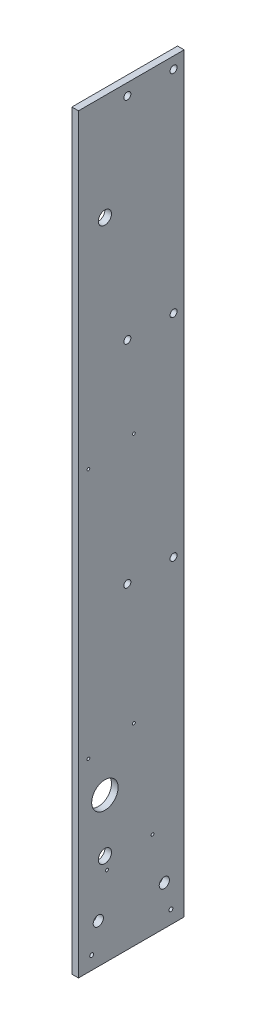
ISO-10303-21;
HEADER;
FILE_DESCRIPTION(('STEP AP214'),'2;1');
FILE_NAME('part.step','',(''),(''),'','','');
FILE_SCHEMA(('AUTOMOTIVE_DESIGN { 1 0 10303 214 1 1 1 1 }'));
ENDSEC;
DATA;
#1=APPLICATION_CONTEXT('core data for automotive mechanical design processes');
#2=APPLICATION_PROTOCOL_DEFINITION('international standard','automotive_design',2000,#1);
#3=PRODUCT_CONTEXT('',#1,'mechanical');
#4=PRODUCT('Part','Part','',(#3));
#5=PRODUCT_RELATED_PRODUCT_CATEGORY('part','',(#4));
#6=PRODUCT_DEFINITION_FORMATION('','',#4);
#7=PRODUCT_DEFINITION_CONTEXT('part definition',#1,'design');
#8=PRODUCT_DEFINITION('design','',#6,#7);
#9=PRODUCT_DEFINITION_SHAPE('','',#8);
#10=(LENGTH_UNIT() NAMED_UNIT(*) SI_UNIT(.MILLI.,.METRE.));
#11=(NAMED_UNIT(*) PLANE_ANGLE_UNIT() SI_UNIT($,.RADIAN.));
#12=(NAMED_UNIT(*) SI_UNIT($,.STERADIAN.) SOLID_ANGLE_UNIT());
#13=UNCERTAINTY_MEASURE_WITH_UNIT(LENGTH_MEASURE(1.E-05),#10,'distance_accuracy_value','');
#14=(GEOMETRIC_REPRESENTATION_CONTEXT(3) GLOBAL_UNCERTAINTY_ASSIGNED_CONTEXT((#13)) GLOBAL_UNIT_ASSIGNED_CONTEXT((#10,
#11,#12)) REPRESENTATION_CONTEXT('',''));
#15=CARTESIAN_POINT('',(0.,0.,0.));
#16=DIRECTION('',(0.,0.,1.));
#17=DIRECTION('',(1.,0.,0.));
#18=AXIS2_PLACEMENT_3D('',#15,#16,#17);
#19=CARTESIAN_POINT('',(6.35,0.,0.));
#20=DIRECTION('',(-1.,0.,0.));
#21=DIRECTION('',(0.,0.,1.));
#22=AXIS2_PLACEMENT_3D('',#19,#20,#21);
#23=PLANE('',#22);
#24=CARTESIAN_POINT('',(6.35,139.7,-25.4));
#25=DIRECTION('',(1.,0.,0.));
#26=DIRECTION('',(0.,0.,-1.));
#27=AXIS2_PLACEMENT_3D('',#24,#25,#26);
#28=CIRCLE('',#27,12.7);
#29=CARTESIAN_POINT('',(6.35,139.7,-38.1));
#30=VERTEX_POINT('',#29);
#31=EDGE_CURVE('E235',#30,#30,#28,.T.);
#32=ORIENTED_EDGE('',*,*,#31,.F.);
#33=EDGE_LOOP('',(#32));
#34=FACE_BOUND('',#33,.T.);
#35=CARTESIAN_POINT('',(6.35,88.9,-25.4));
#36=DIRECTION('',(1.,0.,0.));
#37=DIRECTION('',(0.,0.,-1.));
#38=AXIS2_PLACEMENT_3D('',#35,#36,#37);
#39=CIRCLE('',#38,6.35);
#40=CARTESIAN_POINT('',(6.35,88.9,-31.75));
#41=VERTEX_POINT('',#40);
#42=EDGE_CURVE('E229',#41,#41,#39,.T.);
#43=ORIENTED_EDGE('',*,*,#42,.F.);
#44=EDGE_LOOP('',(#43));
#45=FACE_BOUND('',#44,.T.);
#46=CARTESIAN_POINT('',(6.35,620.7125,-25.4));
#47=DIRECTION('',(1.,0.,0.));
#48=DIRECTION('',(0.,0.,-1.));
#49=AXIS2_PLACEMENT_3D('',#46,#47,#48);
#50=CIRCLE('',#49,6.35);
#51=CARTESIAN_POINT('',(6.35,620.7125,-31.75));
#52=VERTEX_POINT('',#51);
#53=EDGE_CURVE('E223',#52,#52,#50,.T.);
#54=ORIENTED_EDGE('',*,*,#53,.F.);
#55=EDGE_LOOP('',(#54));
#56=FACE_BOUND('',#55,.T.);
#57=CARTESIAN_POINT('',(6.35,38.1,-19.05));
#58=DIRECTION('',(1.,0.,0.));
#59=DIRECTION('',(0.,0.,-1.));
#60=AXIS2_PLACEMENT_3D('',#57,#58,#59);
#61=CIRCLE('',#60,4.9022);
#62=CARTESIAN_POINT('',(6.35,38.1,-23.9522));
#63=VERTEX_POINT('',#62);
#64=EDGE_CURVE('E219',#63,#63,#61,.T.);
#65=ORIENTED_EDGE('',*,*,#64,.F.);
#66=EDGE_LOOP('',(#65));
#67=FACE_BOUND('',#66,.T.);
#68=CARTESIAN_POINT('',(6.35,38.1,-82.55));
#69=DIRECTION('',(1.,0.,0.));
#70=DIRECTION('',(0.,0.,-1.));
#71=AXIS2_PLACEMENT_3D('',#68,#69,#70);
#72=CIRCLE('',#71,4.9022);
#73=CARTESIAN_POINT('',(6.35,38.1,-87.4522));
#74=VERTEX_POINT('',#73);
#75=EDGE_CURVE('E213',#74,#74,#72,.T.);
#76=ORIENTED_EDGE('',*,*,#75,.F.);
#77=EDGE_LOOP('',(#76));
#78=FACE_BOUND('',#77,.T.);
#79=CARTESIAN_POINT('',(6.35,304.8,-46.99));
#80=DIRECTION('',(1.,0.,0.));
#81=DIRECTION('',(0.,0.,-1.));
#82=AXIS2_PLACEMENT_3D('',#79,#80,#81);
#83=CIRCLE('',#82,3.3782);
#84=CARTESIAN_POINT('',(6.35,304.8,-50.3682));
#85=VERTEX_POINT('',#84);
#86=EDGE_CURVE('E207',#85,#85,#83,.T.);
#87=ORIENTED_EDGE('',*,*,#86,.F.);
#88=EDGE_LOOP('',(#87));
#89=FACE_BOUND('',#88,.T.);
#90=CARTESIAN_POINT('',(6.35,304.8,-91.44));
#91=DIRECTION('',(1.,0.,0.));
#92=DIRECTION('',(0.,0.,-1.));
#93=AXIS2_PLACEMENT_3D('',#90,#91,#92);
#94=CIRCLE('',#93,3.3782);
#95=CARTESIAN_POINT('',(6.35,304.8,-94.8182));
#96=VERTEX_POINT('',#95);
#97=EDGE_CURVE('E201',#96,#96,#94,.T.);
#98=ORIENTED_EDGE('',*,*,#97,.F.);
#99=EDGE_LOOP('',(#98));
#100=FACE_BOUND('',#99,.T.);
#101=CARTESIAN_POINT('',(6.35,508.,-46.99));
#102=DIRECTION('',(1.,0.,0.));
#103=DIRECTION('',(0.,0.,-1.));
#104=AXIS2_PLACEMENT_3D('',#101,#102,#103);
#105=CIRCLE('',#104,3.3782);
#106=CARTESIAN_POINT('',(6.35,508.,-50.3682));
#107=VERTEX_POINT('',#106);
#108=EDGE_CURVE('E195',#107,#107,#105,.T.);
#109=ORIENTED_EDGE('',*,*,#108,.F.);
#110=EDGE_LOOP('',(#109));
#111=FACE_BOUND('',#110,.T.);
#112=CARTESIAN_POINT('',(6.35,508.,-91.44));
#113=DIRECTION('',(1.,0.,0.));
#114=DIRECTION('',(0.,0.,-1.));
#115=AXIS2_PLACEMENT_3D('',#112,#113,#114);
#116=CIRCLE('',#115,3.3782);
#117=CARTESIAN_POINT('',(6.35,508.,-94.8182));
#118=VERTEX_POINT('',#117);
#119=EDGE_CURVE('E189',#118,#118,#116,.T.);
#120=ORIENTED_EDGE('',*,*,#119,.F.);
#121=EDGE_LOOP('',(#120));
#122=FACE_BOUND('',#121,.T.);
#123=CARTESIAN_POINT('',(6.35,711.2,-46.99));
#124=DIRECTION('',(1.,0.,0.));
#125=DIRECTION('',(0.,0.,-1.));
#126=AXIS2_PLACEMENT_3D('',#123,#124,#125);
#127=CIRCLE('',#126,3.3782);
#128=CARTESIAN_POINT('',(6.35,711.2,-50.3682));
#129=VERTEX_POINT('',#128);
#130=EDGE_CURVE('E183',#129,#129,#127,.T.);
#131=ORIENTED_EDGE('',*,*,#130,.F.);
#132=EDGE_LOOP('',(#131));
#133=FACE_BOUND('',#132,.T.);
#134=CARTESIAN_POINT('',(6.35,711.2,-91.44));
#135=DIRECTION('',(1.,0.,0.));
#136=DIRECTION('',(0.,0.,-1.));
#137=AXIS2_PLACEMENT_3D('',#134,#135,#136);
#138=CIRCLE('',#137,3.3782);
#139=CARTESIAN_POINT('',(6.35,711.2,-94.8182));
#140=VERTEX_POINT('',#139);
#141=EDGE_CURVE('E177',#140,#140,#138,.T.);
#142=ORIENTED_EDGE('',*,*,#141,.F.);
#143=EDGE_LOOP('',(#142));
#144=FACE_BOUND('',#143,.T.);
#145=CARTESIAN_POINT('',(6.35,177.8,-9.52500000000009));
#146=DIRECTION('',(1.,0.,0.));
#147=DIRECTION('',(0.,0.,-1.));
#148=AXIS2_PLACEMENT_3D('',#145,#146,#147);
#149=CIRCLE('',#148,1.35255000000001);
#150=CARTESIAN_POINT('',(6.35,177.8,-10.8775500000001));
#151=VERTEX_POINT('',#150);
#152=EDGE_CURVE('E159',#151,#151,#149,.T.);
#153=ORIENTED_EDGE('',*,*,#152,.F.);
#154=EDGE_LOOP('',(#153));
#155=FACE_BOUND('',#154,.T.);
#156=CARTESIAN_POINT('',(6.35,185.518661497295,-53.2997046213928));
#157=DIRECTION('',(1.,0.,0.));
#158=DIRECTION('',(0.,0.,-1.));
#159=AXIS2_PLACEMENT_3D('',#156,#157,#158);
#160=CIRCLE('',#159,1.35255000000001);
#161=CARTESIAN_POINT('',(6.35,185.518661497295,-54.6522546213928));
#162=VERTEX_POINT('',#161);
#163=EDGE_CURVE('E153',#162,#162,#160,.T.);
#164=ORIENTED_EDGE('',*,*,#163,.F.);
#165=EDGE_LOOP('',(#164));
#166=FACE_BOUND('',#165,.T.);
#167=CARTESIAN_POINT('',(6.35,76.2,-27.4396200000001));
#168=DIRECTION('',(1.,0.,0.));
#169=DIRECTION('',(0.,0.,-1.));
#170=AXIS2_PLACEMENT_3D('',#167,#168,#169);
#171=CIRCLE('',#170,1.35254999999999);
#172=CARTESIAN_POINT('',(6.35,76.2,-28.7921700000001));
#173=VERTEX_POINT('',#172);
#174=EDGE_CURVE('E147',#173,#173,#171,.T.);
#175=ORIENTED_EDGE('',*,*,#174,.F.);
#176=EDGE_LOOP('',(#175));
#177=FACE_BOUND('',#176,.T.);
#178=CARTESIAN_POINT('',(6.35,83.9186614972951,-71.2143246780001));
#179=DIRECTION('',(1.,0.,0.));
#180=DIRECTION('',(0.,0.,-1.));
#181=AXIS2_PLACEMENT_3D('',#178,#179,#180);
#182=CIRCLE('',#181,1.35254999999999);
#183=CARTESIAN_POINT('',(6.35,83.9186614972951,-72.5668746780001));
#184=VERTEX_POINT('',#183);
#185=EDGE_CURVE('E141',#184,#184,#182,.T.);
#186=ORIENTED_EDGE('',*,*,#185,.F.);
#187=EDGE_LOOP('',(#186));
#188=FACE_BOUND('',#187,.T.);
#189=CARTESIAN_POINT('',(6.35,419.1,-9.52500000000006));
#190=DIRECTION('',(1.,0.,0.));
#191=DIRECTION('',(0.,0.,-1.));
#192=AXIS2_PLACEMENT_3D('',#189,#190,#191);
#193=CIRCLE('',#192,1.35255000000001);
#194=CARTESIAN_POINT('',(6.35,419.1,-10.8775500000001));
#195=VERTEX_POINT('',#194);
#196=EDGE_CURVE('E135',#195,#195,#193,.T.);
#197=ORIENTED_EDGE('',*,*,#196,.F.);
#198=EDGE_LOOP('',(#197));
#199=FACE_BOUND('',#198,.T.);
#200=CARTESIAN_POINT('',(6.35,426.818661497295,-53.2997046213928));
#201=DIRECTION('',(1.,0.,0.));
#202=DIRECTION('',(0.,0.,-1.));
#203=AXIS2_PLACEMENT_3D('',#200,#201,#202);
#204=CIRCLE('',#203,1.35255000000001);
#205=CARTESIAN_POINT('',(6.35,426.818661497295,-54.6522546213928));
#206=VERTEX_POINT('',#205);
#207=EDGE_CURVE('E129',#206,#206,#204,.T.);
#208=ORIENTED_EDGE('',*,*,#207,.F.);
#209=EDGE_LOOP('',(#208));
#210=FACE_BOUND('',#209,.T.);
#211=DIRECTION('',(0.,-1.,0.));
#212=VECTOR('',#211,1.);
#213=CARTESIAN_POINT('',(6.35,0.,0.));
#214=LINE('',#213,#212);
#215=CARTESIAN_POINT('',(6.35,722.3125,0.));
#216=VERTEX_POINT('',#215);
#217=CARTESIAN_POINT('',(6.35,0.,0.));
#218=VERTEX_POINT('',#217);
#219=EDGE_CURVE('E101',#216,#218,#214,.T.);
#220=ORIENTED_EDGE('',*,*,#219,.T.);
#221=DIRECTION('',(0.,0.,-1.));
#222=VECTOR('',#221,1.);
#223=CARTESIAN_POINT('',(6.35,0.,0.));
#224=LINE('',#223,#222);
#225=CARTESIAN_POINT('',(6.35,0.,-101.6));
#226=VERTEX_POINT('',#225);
#227=EDGE_CURVE('E96',#218,#226,#224,.T.);
#228=ORIENTED_EDGE('',*,*,#227,.T.);
#229=DIRECTION('',(0.,1.,0.));
#230=VECTOR('',#229,1.);
#231=CARTESIAN_POINT('',(6.35,0.,-101.6));
#232=LINE('',#231,#230);
#233=CARTESIAN_POINT('',(6.35,722.3125,-101.6));
#234=VERTEX_POINT('',#233);
#235=EDGE_CURVE('E99',#226,#234,#232,.T.);
#236=ORIENTED_EDGE('',*,*,#235,.T.);
#237=DIRECTION('',(0.,0.,1.));
#238=VECTOR('',#237,1.);
#239=CARTESIAN_POINT('',(6.35,722.3125,0.));
#240=LINE('',#239,#238);
#241=EDGE_CURVE('E66',#234,#216,#240,.T.);
#242=ORIENTED_EDGE('',*,*,#241,.T.);
#243=EDGE_LOOP('',(#220,#228,#236,#242));
#244=FACE_BOUND('',#243,.T.);
#245=CARTESIAN_POINT('',(6.35,12.7,-88.9));
#246=DIRECTION('',(1.,0.,0.));
#247=DIRECTION('',(0.,0.,-1.));
#248=AXIS2_PLACEMENT_3D('',#245,#246,#247);
#249=CIRCLE('',#248,1.89865);
#250=CARTESIAN_POINT('',(6.35,12.7,-90.79865));
#251=VERTEX_POINT('',#250);
#252=EDGE_CURVE('E165',#251,#251,#249,.T.);
#253=ORIENTED_EDGE('',*,*,#252,.F.);
#254=EDGE_LOOP('',(#253));
#255=FACE_BOUND('',#254,.T.);
#256=CARTESIAN_POINT('',(6.35,12.7,-12.7));
#257=DIRECTION('',(1.,0.,0.));
#258=DIRECTION('',(0.,0.,-1.));
#259=AXIS2_PLACEMENT_3D('',#256,#257,#258);
#260=CIRCLE('',#259,1.89865);
#261=CARTESIAN_POINT('',(6.35,12.7,-14.59865));
#262=VERTEX_POINT('',#261);
#263=EDGE_CURVE('E171',#262,#262,#260,.T.);
#264=ORIENTED_EDGE('',*,*,#263,.F.);
#265=EDGE_LOOP('',(#264));
#266=FACE_BOUND('',#265,.T.);
#267=ADVANCED_FACE('F49',(#34,#45,#56,#67,#78,#89,#100,#111,#122,#133,#144,#155,#166,#177,#188,
#199,#210,#244,#255,#266),#23,.F.);
#268=CARTESIAN_POINT('',(6.35,0.,0.));
#269=DIRECTION('',(0.,0.,-1.));
#270=DIRECTION('',(-1.,0.,0.));
#271=AXIS2_PLACEMENT_3D('',#268,#269,#270);
#272=PLANE('',#271);
#273=DIRECTION('',(0.,-1.,0.));
#274=VECTOR('',#273,1.);
#275=CARTESIAN_POINT('',(0.,0.,0.));
#276=LINE('',#275,#274);
#277=CARTESIAN_POINT('',(0.,722.3125,0.));
#278=VERTEX_POINT('',#277);
#279=CARTESIAN_POINT('',(0.,0.,0.));
#280=VERTEX_POINT('',#279);
#281=EDGE_CURVE('E113',#278,#280,#276,.T.);
#282=ORIENTED_EDGE('',*,*,#281,.T.);
#283=DIRECTION('',(-1.,0.,0.));
#284=VECTOR('',#283,1.);
#285=CARTESIAN_POINT('',(6.35,0.,0.));
#286=LINE('',#285,#284);
#287=EDGE_CURVE('E11',#218,#280,#286,.T.);
#288=ORIENTED_EDGE('',*,*,#287,.F.);
#289=ORIENTED_EDGE('',*,*,#219,.F.);
#290=DIRECTION('',(-1.,0.,0.));
#291=VECTOR('',#290,1.);
#292=CARTESIAN_POINT('',(6.35,722.3125,0.));
#293=LINE('',#292,#291);
#294=EDGE_CURVE('E109',#216,#278,#293,.T.);
#295=ORIENTED_EDGE('',*,*,#294,.T.);
#296=EDGE_LOOP('',(#282,#288,#289,#295));
#297=FACE_BOUND('',#296,.T.);
#298=ADVANCED_FACE('F51',(#297),#272,.F.);
#299=CARTESIAN_POINT('',(6.35,0.,0.));
#300=DIRECTION('',(0.,1.,0.));
#301=DIRECTION('',(0.,0.,1.));
#302=AXIS2_PLACEMENT_3D('',#299,#300,#301);
#303=PLANE('',#302);
#304=DIRECTION('',(0.,0.,-1.));
#305=VECTOR('',#304,1.);
#306=CARTESIAN_POINT('',(0.,0.,0.));
#307=LINE('',#306,#305);
#308=CARTESIAN_POINT('',(0.,0.,-101.6));
#309=VERTEX_POINT('',#308);
#310=EDGE_CURVE('E105',#280,#309,#307,.T.);
#311=ORIENTED_EDGE('',*,*,#310,.T.);
#312=DIRECTION('',(-1.,0.,0.));
#313=VECTOR('',#312,1.);
#314=CARTESIAN_POINT('',(6.35,0.,-101.6));
#315=LINE('',#314,#313);
#316=EDGE_CURVE('E58',#226,#309,#315,.T.);
#317=ORIENTED_EDGE('',*,*,#316,.F.);
#318=ORIENTED_EDGE('',*,*,#227,.F.);
#319=ORIENTED_EDGE('',*,*,#287,.T.);
#320=EDGE_LOOP('',(#311,#317,#318,#319));
#321=FACE_BOUND('',#320,.T.);
#322=ADVANCED_FACE('F104',(#321),#303,.F.);
#323=CARTESIAN_POINT('',(6.35,0.,-101.6));
#324=DIRECTION('',(0.,0.,1.));
#325=DIRECTION('',(1.,0.,0.));
#326=AXIS2_PLACEMENT_3D('',#323,#324,#325);
#327=PLANE('',#326);
#328=DIRECTION('',(0.,1.,0.));
#329=VECTOR('',#328,1.);
#330=CARTESIAN_POINT('',(0.,0.,-101.6));
#331=LINE('',#330,#329);
#332=CARTESIAN_POINT('',(0.,722.3125,-101.6));
#333=VERTEX_POINT('',#332);
#334=EDGE_CURVE('E83',#309,#333,#331,.T.);
#335=ORIENTED_EDGE('',*,*,#334,.T.);
#336=DIRECTION('',(-1.,0.,0.));
#337=VECTOR('',#336,1.);
#338=CARTESIAN_POINT('',(6.35,722.3125,-101.6));
#339=LINE('',#338,#337);
#340=EDGE_CURVE('E106',#234,#333,#339,.T.);
#341=ORIENTED_EDGE('',*,*,#340,.F.);
#342=ORIENTED_EDGE('',*,*,#235,.F.);
#343=ORIENTED_EDGE('',*,*,#316,.T.);
#344=EDGE_LOOP('',(#335,#341,#342,#343));
#345=FACE_BOUND('',#344,.T.);
#346=ADVANCED_FACE('F107',(#345),#327,.F.);
#347=CARTESIAN_POINT('',(6.35,722.3125,0.));
#348=DIRECTION('',(0.,-1.,0.));
#349=DIRECTION('',(0.,0.,-1.));
#350=AXIS2_PLACEMENT_3D('',#347,#348,#349);
#351=PLANE('',#350);
#352=DIRECTION('',(0.,0.,1.));
#353=VECTOR('',#352,1.);
#354=CARTESIAN_POINT('',(0.,722.3125,0.));
#355=LINE('',#354,#353);
#356=EDGE_CURVE('E89',#333,#278,#355,.T.);
#357=ORIENTED_EDGE('',*,*,#356,.T.);
#358=ORIENTED_EDGE('',*,*,#294,.F.);
#359=ORIENTED_EDGE('',*,*,#241,.F.);
#360=ORIENTED_EDGE('',*,*,#340,.T.);
#361=EDGE_LOOP('',(#357,#358,#359,#360));
#362=FACE_BOUND('',#361,.T.);
#363=ADVANCED_FACE('F121',(#362),#351,.F.);
#364=CARTESIAN_POINT('',(0.,0.,0.));
#365=DIRECTION('',(-1.,0.,0.));
#366=DIRECTION('',(0.,0.,1.));
#367=AXIS2_PLACEMENT_3D('',#364,#365,#366);
#368=PLANE('',#367);
#369=CARTESIAN_POINT('',(0.,139.7,-25.4));
#370=DIRECTION('',(1.,0.,0.));
#371=DIRECTION('',(0.,0.,-1.));
#372=AXIS2_PLACEMENT_3D('',#369,#370,#371);
#373=CIRCLE('',#372,12.7);
#374=CARTESIAN_POINT('',(0.,139.7,-38.1));
#375=VERTEX_POINT('',#374);
#376=EDGE_CURVE('E232',#375,#375,#373,.T.);
#377=ORIENTED_EDGE('',*,*,#376,.T.);
#378=EDGE_LOOP('',(#377));
#379=FACE_BOUND('',#378,.T.);
#380=CARTESIAN_POINT('',(0.,88.9,-25.4));
#381=DIRECTION('',(1.,0.,0.));
#382=DIRECTION('',(0.,0.,-1.));
#383=AXIS2_PLACEMENT_3D('',#380,#381,#382);
#384=CIRCLE('',#383,6.35);
#385=CARTESIAN_POINT('',(0.,88.9,-31.75));
#386=VERTEX_POINT('',#385);
#387=EDGE_CURVE('E226',#386,#386,#384,.T.);
#388=ORIENTED_EDGE('',*,*,#387,.T.);
#389=EDGE_LOOP('',(#388));
#390=FACE_BOUND('',#389,.T.);
#391=CARTESIAN_POINT('',(0.,620.7125,-25.4));
#392=DIRECTION('',(1.,0.,0.));
#393=DIRECTION('',(0.,0.,-1.));
#394=AXIS2_PLACEMENT_3D('',#391,#392,#393);
#395=CIRCLE('',#394,6.35);
#396=CARTESIAN_POINT('',(0.,620.7125,-31.75));
#397=VERTEX_POINT('',#396);
#398=EDGE_CURVE('E222',#397,#397,#395,.T.);
#399=ORIENTED_EDGE('',*,*,#398,.T.);
#400=EDGE_LOOP('',(#399));
#401=FACE_BOUND('',#400,.T.);
#402=CARTESIAN_POINT('',(0.,38.1,-19.05));
#403=DIRECTION('',(1.,0.,0.));
#404=DIRECTION('',(0.,0.,-1.));
#405=AXIS2_PLACEMENT_3D('',#402,#403,#404);
#406=CIRCLE('',#405,4.9022);
#407=CARTESIAN_POINT('',(0.,38.1,-23.9522));
#408=VERTEX_POINT('',#407);
#409=EDGE_CURVE('E216',#408,#408,#406,.T.);
#410=ORIENTED_EDGE('',*,*,#409,.T.);
#411=EDGE_LOOP('',(#410));
#412=FACE_BOUND('',#411,.T.);
#413=CARTESIAN_POINT('',(0.,38.1,-82.55));
#414=DIRECTION('',(1.,0.,0.));
#415=DIRECTION('',(0.,0.,-1.));
#416=AXIS2_PLACEMENT_3D('',#413,#414,#415);
#417=CIRCLE('',#416,4.9022);
#418=CARTESIAN_POINT('',(0.,38.1,-87.4522));
#419=VERTEX_POINT('',#418);
#420=EDGE_CURVE('E210',#419,#419,#417,.T.);
#421=ORIENTED_EDGE('',*,*,#420,.T.);
#422=EDGE_LOOP('',(#421));
#423=FACE_BOUND('',#422,.T.);
#424=CARTESIAN_POINT('',(0.,304.8,-46.99));
#425=DIRECTION('',(1.,0.,0.));
#426=DIRECTION('',(0.,0.,-1.));
#427=AXIS2_PLACEMENT_3D('',#424,#425,#426);
#428=CIRCLE('',#427,3.3782);
#429=CARTESIAN_POINT('',(0.,304.8,-50.3682));
#430=VERTEX_POINT('',#429);
#431=EDGE_CURVE('E204',#430,#430,#428,.T.);
#432=ORIENTED_EDGE('',*,*,#431,.T.);
#433=EDGE_LOOP('',(#432));
#434=FACE_BOUND('',#433,.T.);
#435=CARTESIAN_POINT('',(0.,304.8,-91.44));
#436=DIRECTION('',(1.,0.,0.));
#437=DIRECTION('',(0.,0.,-1.));
#438=AXIS2_PLACEMENT_3D('',#435,#436,#437);
#439=CIRCLE('',#438,3.3782);
#440=CARTESIAN_POINT('',(0.,304.8,-94.8182));
#441=VERTEX_POINT('',#440);
#442=EDGE_CURVE('E198',#441,#441,#439,.T.);
#443=ORIENTED_EDGE('',*,*,#442,.T.);
#444=EDGE_LOOP('',(#443));
#445=FACE_BOUND('',#444,.T.);
#446=CARTESIAN_POINT('',(0.,508.,-46.99));
#447=DIRECTION('',(1.,0.,0.));
#448=DIRECTION('',(0.,0.,-1.));
#449=AXIS2_PLACEMENT_3D('',#446,#447,#448);
#450=CIRCLE('',#449,3.3782);
#451=CARTESIAN_POINT('',(0.,508.,-50.3682));
#452=VERTEX_POINT('',#451);
#453=EDGE_CURVE('E192',#452,#452,#450,.T.);
#454=ORIENTED_EDGE('',*,*,#453,.T.);
#455=EDGE_LOOP('',(#454));
#456=FACE_BOUND('',#455,.T.);
#457=CARTESIAN_POINT('',(0.,508.,-91.44));
#458=DIRECTION('',(1.,0.,0.));
#459=DIRECTION('',(0.,0.,-1.));
#460=AXIS2_PLACEMENT_3D('',#457,#458,#459);
#461=CIRCLE('',#460,3.3782);
#462=CARTESIAN_POINT('',(0.,508.,-94.8182));
#463=VERTEX_POINT('',#462);
#464=EDGE_CURVE('E186',#463,#463,#461,.T.);
#465=ORIENTED_EDGE('',*,*,#464,.T.);
#466=EDGE_LOOP('',(#465));
#467=FACE_BOUND('',#466,.T.);
#468=CARTESIAN_POINT('',(0.,711.2,-46.99));
#469=DIRECTION('',(1.,0.,0.));
#470=DIRECTION('',(0.,0.,-1.));
#471=AXIS2_PLACEMENT_3D('',#468,#469,#470);
#472=CIRCLE('',#471,3.3782);
#473=CARTESIAN_POINT('',(0.,711.2,-50.3682));
#474=VERTEX_POINT('',#473);
#475=EDGE_CURVE('E180',#474,#474,#472,.T.);
#476=ORIENTED_EDGE('',*,*,#475,.T.);
#477=EDGE_LOOP('',(#476));
#478=FACE_BOUND('',#477,.T.);
#479=CARTESIAN_POINT('',(0.,711.2,-91.44));
#480=DIRECTION('',(1.,0.,0.));
#481=DIRECTION('',(0.,0.,-1.));
#482=AXIS2_PLACEMENT_3D('',#479,#480,#481);
#483=CIRCLE('',#482,3.3782);
#484=CARTESIAN_POINT('',(0.,711.2,-94.8182));
#485=VERTEX_POINT('',#484);
#486=EDGE_CURVE('E174',#485,#485,#483,.T.);
#487=ORIENTED_EDGE('',*,*,#486,.T.);
#488=EDGE_LOOP('',(#487));
#489=FACE_BOUND('',#488,.T.);
#490=CARTESIAN_POINT('',(0.,12.7,-12.7));
#491=DIRECTION('',(-1.,0.,0.));
#492=DIRECTION('',(0.,0.,1.));
#493=AXIS2_PLACEMENT_3D('',#490,#491,#492);
#494=CIRCLE('',#493,1.89865);
#495=CARTESIAN_POINT('',(0.,12.7,-10.80135));
#496=VERTEX_POINT('',#495);
#497=EDGE_CURVE('E168',#496,#496,#494,.T.);
#498=ORIENTED_EDGE('',*,*,#497,.F.);
#499=EDGE_LOOP('',(#498));
#500=FACE_BOUND('',#499,.T.);
#501=CARTESIAN_POINT('',(0.,12.7,-88.9));
#502=DIRECTION('',(-1.,0.,0.));
#503=DIRECTION('',(0.,0.,1.));
#504=AXIS2_PLACEMENT_3D('',#501,#502,#503);
#505=CIRCLE('',#504,1.89865);
#506=CARTESIAN_POINT('',(0.,12.7,-87.00135));
#507=VERTEX_POINT('',#506);
#508=EDGE_CURVE('E162',#507,#507,#505,.T.);
#509=ORIENTED_EDGE('',*,*,#508,.F.);
#510=EDGE_LOOP('',(#509));
#511=FACE_BOUND('',#510,.T.);
#512=CARTESIAN_POINT('',(0.,177.8,-9.52500000000009));
#513=DIRECTION('',(1.,0.,0.));
#514=DIRECTION('',(0.,0.,-1.));
#515=AXIS2_PLACEMENT_3D('',#512,#513,#514);
#516=CIRCLE('',#515,1.35255000000001);
#517=CARTESIAN_POINT('',(0.,177.8,-10.8775500000001));
#518=VERTEX_POINT('',#517);
#519=EDGE_CURVE('E156',#518,#518,#516,.T.);
#520=ORIENTED_EDGE('',*,*,#519,.T.);
#521=EDGE_LOOP('',(#520));
#522=FACE_BOUND('',#521,.T.);
#523=CARTESIAN_POINT('',(0.,185.518661497295,-53.2997046213928));
#524=DIRECTION('',(1.,0.,0.));
#525=DIRECTION('',(0.,0.,-1.));
#526=AXIS2_PLACEMENT_3D('',#523,#524,#525);
#527=CIRCLE('',#526,1.35255000000001);
#528=CARTESIAN_POINT('',(0.,185.518661497295,-54.6522546213928));
#529=VERTEX_POINT('',#528);
#530=EDGE_CURVE('E150',#529,#529,#527,.T.);
#531=ORIENTED_EDGE('',*,*,#530,.T.);
#532=EDGE_LOOP('',(#531));
#533=FACE_BOUND('',#532,.T.);
#534=CARTESIAN_POINT('',(0.,76.2,-27.4396200000001));
#535=DIRECTION('',(1.,0.,0.));
#536=DIRECTION('',(0.,0.,-1.));
#537=AXIS2_PLACEMENT_3D('',#534,#535,#536);
#538=CIRCLE('',#537,1.35254999999999);
#539=CARTESIAN_POINT('',(0.,76.2,-28.7921700000001));
#540=VERTEX_POINT('',#539);
#541=EDGE_CURVE('E144',#540,#540,#538,.T.);
#542=ORIENTED_EDGE('',*,*,#541,.T.);
#543=EDGE_LOOP('',(#542));
#544=FACE_BOUND('',#543,.T.);
#545=CARTESIAN_POINT('',(0.,83.9186614972951,-71.2143246780001));
#546=DIRECTION('',(1.,0.,0.));
#547=DIRECTION('',(0.,0.,-1.));
#548=AXIS2_PLACEMENT_3D('',#545,#546,#547);
#549=CIRCLE('',#548,1.35254999999999);
#550=CARTESIAN_POINT('',(0.,83.9186614972951,-72.5668746780001));
#551=VERTEX_POINT('',#550);
#552=EDGE_CURVE('E138',#551,#551,#549,.T.);
#553=ORIENTED_EDGE('',*,*,#552,.T.);
#554=EDGE_LOOP('',(#553));
#555=FACE_BOUND('',#554,.T.);
#556=CARTESIAN_POINT('',(0.,419.1,-9.52500000000006));
#557=DIRECTION('',(1.,0.,0.));
#558=DIRECTION('',(0.,0.,-1.));
#559=AXIS2_PLACEMENT_3D('',#556,#557,#558);
#560=CIRCLE('',#559,1.35255000000001);
#561=CARTESIAN_POINT('',(0.,419.1,-10.8775500000001));
#562=VERTEX_POINT('',#561);
#563=EDGE_CURVE('E132',#562,#562,#560,.T.);
#564=ORIENTED_EDGE('',*,*,#563,.T.);
#565=EDGE_LOOP('',(#564));
#566=FACE_BOUND('',#565,.T.);
#567=CARTESIAN_POINT('',(0.,426.818661497295,-53.2997046213928));
#568=DIRECTION('',(1.,0.,0.));
#569=DIRECTION('',(0.,0.,-1.));
#570=AXIS2_PLACEMENT_3D('',#567,#568,#569);
#571=CIRCLE('',#570,1.35255000000001);
#572=CARTESIAN_POINT('',(0.,426.818661497295,-54.6522546213928));
#573=VERTEX_POINT('',#572);
#574=EDGE_CURVE('E116',#573,#573,#571,.T.);
#575=ORIENTED_EDGE('',*,*,#574,.T.);
#576=EDGE_LOOP('',(#575));
#577=FACE_BOUND('',#576,.T.);
#578=ORIENTED_EDGE('',*,*,#281,.F.);
#579=ORIENTED_EDGE('',*,*,#356,.F.);
#580=ORIENTED_EDGE('',*,*,#334,.F.);
#581=ORIENTED_EDGE('',*,*,#310,.F.);
#582=EDGE_LOOP('',(#578,#579,#580,#581));
#583=FACE_BOUND('',#582,.T.);
#584=ADVANCED_FACE('F124',(#379,#390,#401,#412,#423,#434,#445,#456,#467,#478,#489,#500,#511,
#522,#533,#544,#555,#566,#577,#583),#368,.T.);
#585=CARTESIAN_POINT('',(6.35,426.818661497295,-53.2997046213928));
#586=DIRECTION('',(1.,0.,0.));
#587=DIRECTION('',(0.,0.,-1.));
#588=AXIS2_PLACEMENT_3D('',#585,#586,#587);
#589=CYLINDRICAL_SURFACE('',#588,1.35255000000001);
#590=ORIENTED_EDGE('',*,*,#574,.F.);
#591=EDGE_LOOP('',(#590));
#592=FACE_BOUND('',#591,.T.);
#593=ORIENTED_EDGE('',*,*,#207,.T.);
#594=EDGE_LOOP('',(#593));
#595=FACE_BOUND('',#594,.T.);
#596=ADVANCED_FACE('F285',(#592,#595),#589,.F.);
#597=CARTESIAN_POINT('',(6.35,419.1,-9.52500000000006));
#598=DIRECTION('',(1.,0.,0.));
#599=DIRECTION('',(0.,0.,-1.));
#600=AXIS2_PLACEMENT_3D('',#597,#598,#599);
#601=CYLINDRICAL_SURFACE('',#600,1.35255000000001);
#602=ORIENTED_EDGE('',*,*,#563,.F.);
#603=EDGE_LOOP('',(#602));
#604=FACE_BOUND('',#603,.T.);
#605=ORIENTED_EDGE('',*,*,#196,.T.);
#606=EDGE_LOOP('',(#605));
#607=FACE_BOUND('',#606,.T.);
#608=ADVANCED_FACE('F287',(#604,#607),#601,.F.);
#609=CARTESIAN_POINT('',(6.35,83.9186614972951,-71.2143246780001));
#610=DIRECTION('',(1.,0.,0.));
#611=DIRECTION('',(0.,0.,-1.));
#612=AXIS2_PLACEMENT_3D('',#609,#610,#611);
#613=CYLINDRICAL_SURFACE('',#612,1.35254999999999);
#614=ORIENTED_EDGE('',*,*,#552,.F.);
#615=EDGE_LOOP('',(#614));
#616=FACE_BOUND('',#615,.T.);
#617=ORIENTED_EDGE('',*,*,#185,.T.);
#618=EDGE_LOOP('',(#617));
#619=FACE_BOUND('',#618,.T.);
#620=ADVANCED_FACE('F293',(#616,#619),#613,.F.);
#621=CARTESIAN_POINT('',(6.35,76.2,-27.4396200000001));
#622=DIRECTION('',(1.,0.,0.));
#623=DIRECTION('',(0.,0.,-1.));
#624=AXIS2_PLACEMENT_3D('',#621,#622,#623);
#625=CYLINDRICAL_SURFACE('',#624,1.35254999999999);
#626=ORIENTED_EDGE('',*,*,#541,.F.);
#627=EDGE_LOOP('',(#626));
#628=FACE_BOUND('',#627,.T.);
#629=ORIENTED_EDGE('',*,*,#174,.T.);
#630=EDGE_LOOP('',(#629));
#631=FACE_BOUND('',#630,.T.);
#632=ADVANCED_FACE('F359',(#628,#631),#625,.F.);
#633=CARTESIAN_POINT('',(6.35,185.518661497295,-53.2997046213928));
#634=DIRECTION('',(1.,0.,0.));
#635=DIRECTION('',(0.,0.,-1.));
#636=AXIS2_PLACEMENT_3D('',#633,#634,#635);
#637=CYLINDRICAL_SURFACE('',#636,1.35255000000001);
#638=ORIENTED_EDGE('',*,*,#530,.F.);
#639=EDGE_LOOP('',(#638));
#640=FACE_BOUND('',#639,.T.);
#641=ORIENTED_EDGE('',*,*,#163,.T.);
#642=EDGE_LOOP('',(#641));
#643=FACE_BOUND('',#642,.T.);
#644=ADVANCED_FACE('F370',(#640,#643),#637,.F.);
#645=CARTESIAN_POINT('',(6.35,177.8,-9.52500000000009));
#646=DIRECTION('',(1.,0.,0.));
#647=DIRECTION('',(0.,0.,-1.));
#648=AXIS2_PLACEMENT_3D('',#645,#646,#647);
#649=CYLINDRICAL_SURFACE('',#648,1.35255000000001);
#650=ORIENTED_EDGE('',*,*,#519,.F.);
#651=EDGE_LOOP('',(#650));
#652=FACE_BOUND('',#651,.T.);
#653=ORIENTED_EDGE('',*,*,#152,.T.);
#654=EDGE_LOOP('',(#653));
#655=FACE_BOUND('',#654,.T.);
#656=ADVANCED_FACE('F382',(#652,#655),#649,.F.);
#657=CARTESIAN_POINT('',(6.35,12.7,-88.9));
#658=DIRECTION('',(1.,0.,0.));
#659=DIRECTION('',(0.,0.,-1.));
#660=AXIS2_PLACEMENT_3D('',#657,#658,#659);
#661=CYLINDRICAL_SURFACE('',#660,1.89865);
#662=ORIENTED_EDGE('',*,*,#252,.T.);
#663=EDGE_LOOP('',(#662));
#664=FACE_BOUND('',#663,.T.);
#665=ORIENTED_EDGE('',*,*,#508,.T.);
#666=EDGE_LOOP('',(#665));
#667=FACE_BOUND('',#666,.T.);
#668=ADVANCED_FACE('F394',(#664,#667),#661,.F.);
#669=CARTESIAN_POINT('',(6.35,12.7,-12.7));
#670=DIRECTION('',(1.,0.,0.));
#671=DIRECTION('',(0.,0.,-1.));
#672=AXIS2_PLACEMENT_3D('',#669,#670,#671);
#673=CYLINDRICAL_SURFACE('',#672,1.89865);
#674=ORIENTED_EDGE('',*,*,#263,.T.);
#675=EDGE_LOOP('',(#674));
#676=FACE_BOUND('',#675,.T.);
#677=ORIENTED_EDGE('',*,*,#497,.T.);
#678=EDGE_LOOP('',(#677));
#679=FACE_BOUND('',#678,.T.);
#680=ADVANCED_FACE('F413',(#676,#679),#673,.F.);
#681=CARTESIAN_POINT('',(6.35,711.2,-91.44));
#682=DIRECTION('',(1.,0.,0.));
#683=DIRECTION('',(0.,0.,-1.));
#684=AXIS2_PLACEMENT_3D('',#681,#682,#683);
#685=CYLINDRICAL_SURFACE('',#684,3.3782);
#686=ORIENTED_EDGE('',*,*,#486,.F.);
#687=EDGE_LOOP('',(#686));
#688=FACE_BOUND('',#687,.T.);
#689=ORIENTED_EDGE('',*,*,#141,.T.);
#690=EDGE_LOOP('',(#689));
#691=FACE_BOUND('',#690,.T.);
#692=ADVANCED_FACE('F423',(#688,#691),#685,.F.);
#693=CARTESIAN_POINT('',(6.35,711.2,-46.99));
#694=DIRECTION('',(1.,0.,0.));
#695=DIRECTION('',(0.,0.,-1.));
#696=AXIS2_PLACEMENT_3D('',#693,#694,#695);
#697=CYLINDRICAL_SURFACE('',#696,3.3782);
#698=ORIENTED_EDGE('',*,*,#475,.F.);
#699=EDGE_LOOP('',(#698));
#700=FACE_BOUND('',#699,.T.);
#701=ORIENTED_EDGE('',*,*,#130,.T.);
#702=EDGE_LOOP('',(#701));
#703=FACE_BOUND('',#702,.T.);
#704=ADVANCED_FACE('F433',(#700,#703),#697,.F.);
#705=CARTESIAN_POINT('',(6.35,508.,-91.44));
#706=DIRECTION('',(1.,0.,0.));
#707=DIRECTION('',(0.,0.,-1.));
#708=AXIS2_PLACEMENT_3D('',#705,#706,#707);
#709=CYLINDRICAL_SURFACE('',#708,3.3782);
#710=ORIENTED_EDGE('',*,*,#464,.F.);
#711=EDGE_LOOP('',(#710));
#712=FACE_BOUND('',#711,.T.);
#713=ORIENTED_EDGE('',*,*,#119,.T.);
#714=EDGE_LOOP('',(#713));
#715=FACE_BOUND('',#714,.T.);
#716=ADVANCED_FACE('F443',(#712,#715),#709,.F.);
#717=CARTESIAN_POINT('',(6.35,508.,-46.99));
#718=DIRECTION('',(1.,0.,0.));
#719=DIRECTION('',(0.,0.,-1.));
#720=AXIS2_PLACEMENT_3D('',#717,#718,#719);
#721=CYLINDRICAL_SURFACE('',#720,3.3782);
#722=ORIENTED_EDGE('',*,*,#453,.F.);
#723=EDGE_LOOP('',(#722));
#724=FACE_BOUND('',#723,.T.);
#725=ORIENTED_EDGE('',*,*,#108,.T.);
#726=EDGE_LOOP('',(#725));
#727=FACE_BOUND('',#726,.T.);
#728=ADVANCED_FACE('F453',(#724,#727),#721,.F.);
#729=CARTESIAN_POINT('',(6.35,304.8,-91.44));
#730=DIRECTION('',(1.,0.,0.));
#731=DIRECTION('',(0.,0.,-1.));
#732=AXIS2_PLACEMENT_3D('',#729,#730,#731);
#733=CYLINDRICAL_SURFACE('',#732,3.3782);
#734=ORIENTED_EDGE('',*,*,#442,.F.);
#735=EDGE_LOOP('',(#734));
#736=FACE_BOUND('',#735,.T.);
#737=ORIENTED_EDGE('',*,*,#97,.T.);
#738=EDGE_LOOP('',(#737));
#739=FACE_BOUND('',#738,.T.);
#740=ADVANCED_FACE('F463',(#736,#739),#733,.F.);
#741=CARTESIAN_POINT('',(6.35,304.8,-46.99));
#742=DIRECTION('',(1.,0.,0.));
#743=DIRECTION('',(0.,0.,-1.));
#744=AXIS2_PLACEMENT_3D('',#741,#742,#743);
#745=CYLINDRICAL_SURFACE('',#744,3.3782);
#746=ORIENTED_EDGE('',*,*,#431,.F.);
#747=EDGE_LOOP('',(#746));
#748=FACE_BOUND('',#747,.T.);
#749=ORIENTED_EDGE('',*,*,#86,.T.);
#750=EDGE_LOOP('',(#749));
#751=FACE_BOUND('',#750,.T.);
#752=ADVANCED_FACE('F473',(#748,#751),#745,.F.);
#753=CARTESIAN_POINT('',(6.35,38.1,-82.55));
#754=DIRECTION('',(1.,0.,0.));
#755=DIRECTION('',(0.,0.,-1.));
#756=AXIS2_PLACEMENT_3D('',#753,#754,#755);
#757=CYLINDRICAL_SURFACE('',#756,4.9022);
#758=ORIENTED_EDGE('',*,*,#420,.F.);
#759=EDGE_LOOP('',(#758));
#760=FACE_BOUND('',#759,.T.);
#761=ORIENTED_EDGE('',*,*,#75,.T.);
#762=EDGE_LOOP('',(#761));
#763=FACE_BOUND('',#762,.T.);
#764=ADVANCED_FACE('F483',(#760,#763),#757,.F.);
#765=CARTESIAN_POINT('',(6.35,38.1,-19.05));
#766=DIRECTION('',(1.,0.,0.));
#767=DIRECTION('',(0.,0.,-1.));
#768=AXIS2_PLACEMENT_3D('',#765,#766,#767);
#769=CYLINDRICAL_SURFACE('',#768,4.9022);
#770=ORIENTED_EDGE('',*,*,#409,.F.);
#771=EDGE_LOOP('',(#770));
#772=FACE_BOUND('',#771,.T.);
#773=ORIENTED_EDGE('',*,*,#64,.T.);
#774=EDGE_LOOP('',(#773));
#775=FACE_BOUND('',#774,.T.);
#776=ADVANCED_FACE('F493',(#772,#775),#769,.F.);
#777=CARTESIAN_POINT('',(0.,620.7125,-25.4));
#778=DIRECTION('',(1.,0.,0.));
#779=DIRECTION('',(0.,0.,-1.));
#780=AXIS2_PLACEMENT_3D('',#777,#778,#779);
#781=CYLINDRICAL_SURFACE('',#780,6.35);
#782=ORIENTED_EDGE('',*,*,#398,.F.);
#783=EDGE_LOOP('',(#782));
#784=FACE_BOUND('',#783,.T.);
#785=ORIENTED_EDGE('',*,*,#53,.T.);
#786=EDGE_LOOP('',(#785));
#787=FACE_BOUND('',#786,.T.);
#788=ADVANCED_FACE('F503',(#784,#787),#781,.F.);
#789=CARTESIAN_POINT('',(0.,88.9,-25.4));
#790=DIRECTION('',(1.,0.,0.));
#791=DIRECTION('',(0.,0.,-1.));
#792=AXIS2_PLACEMENT_3D('',#789,#790,#791);
#793=CYLINDRICAL_SURFACE('',#792,6.35);
#794=ORIENTED_EDGE('',*,*,#387,.F.);
#795=EDGE_LOOP('',(#794));
#796=FACE_BOUND('',#795,.T.);
#797=ORIENTED_EDGE('',*,*,#42,.T.);
#798=EDGE_LOOP('',(#797));
#799=FACE_BOUND('',#798,.T.);
#800=ADVANCED_FACE('F246',(#796,#799),#793,.F.);
#801=CARTESIAN_POINT('',(0.,139.7,-25.4));
#802=DIRECTION('',(1.,0.,0.));
#803=DIRECTION('',(0.,0.,-1.));
#804=AXIS2_PLACEMENT_3D('',#801,#802,#803);
#805=CYLINDRICAL_SURFACE('',#804,12.7);
#806=ORIENTED_EDGE('',*,*,#376,.F.);
#807=EDGE_LOOP('',(#806));
#808=FACE_BOUND('',#807,.T.);
#809=ORIENTED_EDGE('',*,*,#31,.T.);
#810=EDGE_LOOP('',(#809));
#811=FACE_BOUND('',#810,.T.);
#812=ADVANCED_FACE('F243',(#808,#811),#805,.F.);
#813=CLOSED_SHELL('',(#267,#298,#322,#346,#363,#584,#596,#608,#620,#632,#644,#656,#668,#680,
#692,#704,#716,#728,#740,#752,#764,#776,#788,#800,#812));
#814=MANIFOLD_SOLID_BREP('B2',#813);
#815=ADVANCED_BREP_SHAPE_REPRESENTATION('',(#18,#814),#14);
#816=SHAPE_DEFINITION_REPRESENTATION(#9,#815);
ENDSEC;
END-ISO-10303-21;
